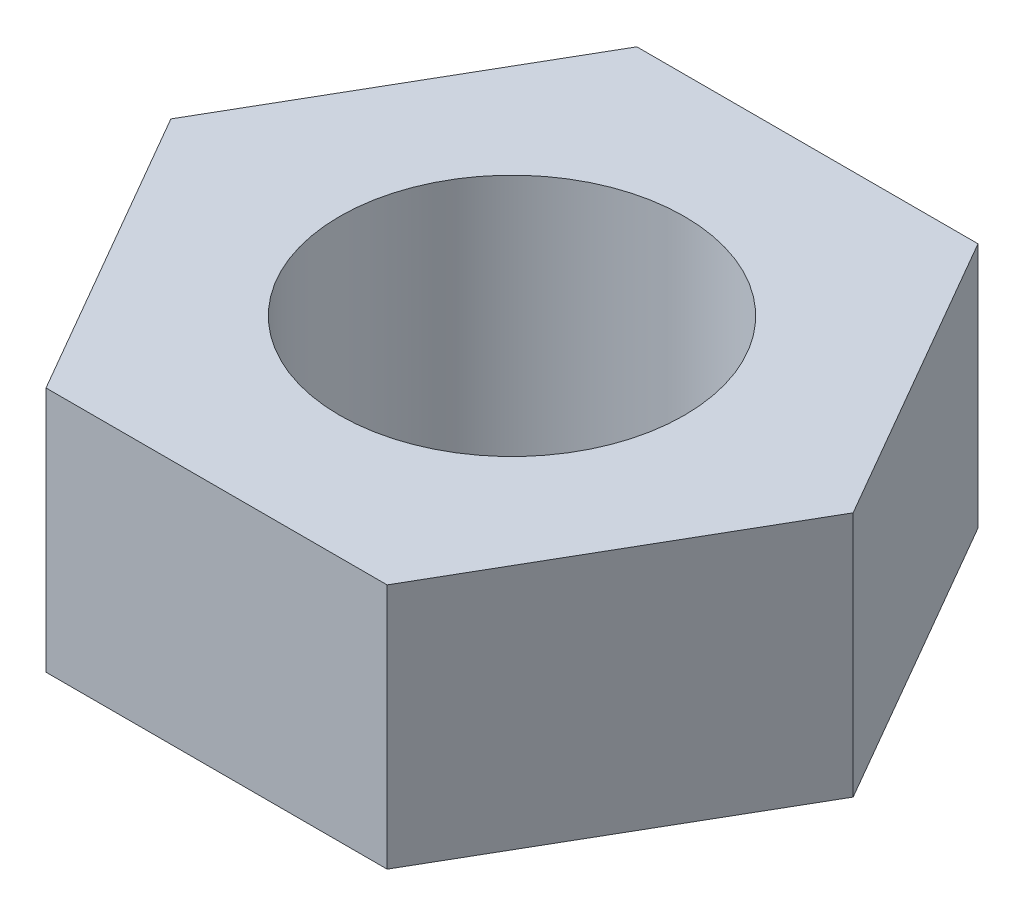
ISO-10303-21;
HEADER;
FILE_DESCRIPTION(('STEP AP214'),'2;1');
FILE_NAME('part.step','',(''),(''),'','','');
FILE_SCHEMA(('AUTOMOTIVE_DESIGN { 1 0 10303 214 1 1 1 1 }'));
ENDSEC;
DATA;
#1=APPLICATION_CONTEXT('core data for automotive mechanical design processes');
#2=APPLICATION_PROTOCOL_DEFINITION('international standard','automotive_design',2000,#1);
#3=PRODUCT_CONTEXT('',#1,'mechanical');
#4=PRODUCT('Part','Part','',(#3));
#5=PRODUCT_RELATED_PRODUCT_CATEGORY('part','',(#4));
#6=PRODUCT_DEFINITION_FORMATION('','',#4);
#7=PRODUCT_DEFINITION_CONTEXT('part definition',#1,'design');
#8=PRODUCT_DEFINITION('design','',#6,#7);
#9=PRODUCT_DEFINITION_SHAPE('','',#8);
#10=(LENGTH_UNIT() NAMED_UNIT(*) SI_UNIT(.MILLI.,.METRE.));
#11=(NAMED_UNIT(*) PLANE_ANGLE_UNIT() SI_UNIT($,.RADIAN.));
#12=(NAMED_UNIT(*) SI_UNIT($,.STERADIAN.) SOLID_ANGLE_UNIT());
#13=UNCERTAINTY_MEASURE_WITH_UNIT(LENGTH_MEASURE(1.E-05),#10,'distance_accuracy_value','');
#14=(GEOMETRIC_REPRESENTATION_CONTEXT(3) GLOBAL_UNCERTAINTY_ASSIGNED_CONTEXT((#13)) GLOBAL_UNIT_ASSIGNED_CONTEXT((#10,
#11,#12)) REPRESENTATION_CONTEXT('',''));
#15=CARTESIAN_POINT('',(0.,0.,0.));
#16=DIRECTION('',(0.,0.,1.));
#17=DIRECTION('',(1.,0.,0.));
#18=AXIS2_PLACEMENT_3D('',#15,#16,#17);
#19=CARTESIAN_POINT('',(0.,10.,0.));
#20=DIRECTION('',(0.,1.,0.));
#21=DIRECTION('',(0.,0.,1.));
#22=AXIS2_PLACEMENT_3D('',#19,#20,#21);
#23=PLANE('',#22);
#24=DIRECTION('',(-0.5,0.,-0.866025403784438));
#25=VECTOR('',#24,1.);
#26=CARTESIAN_POINT('',(13.856406460551,10.,0.));
#27=LINE('',#26,#25);
#28=CARTESIAN_POINT('',(13.856406460551,10.,0.));
#29=VERTEX_POINT('',#28);
#30=CARTESIAN_POINT('',(6.92820323027551,10.,-12.));
#31=VERTEX_POINT('',#30);
#32=EDGE_CURVE('E152',#29,#31,#27,.T.);
#33=ORIENTED_EDGE('',*,*,#32,.T.);
#34=DIRECTION('',(-1.,0.,0.));
#35=VECTOR('',#34,1.);
#36=CARTESIAN_POINT('',(6.92820323027551,10.,-12.));
#37=LINE('',#36,#35);
#38=CARTESIAN_POINT('',(-6.92820323027551,10.,-12.));
#39=VERTEX_POINT('',#38);
#40=EDGE_CURVE('E100',#31,#39,#37,.T.);
#41=ORIENTED_EDGE('',*,*,#40,.T.);
#42=DIRECTION('',(-0.5,0.,0.866025403784438));
#43=VECTOR('',#42,1.);
#44=CARTESIAN_POINT('',(-6.92820323027551,10.,-12.));
#45=LINE('',#44,#43);
#46=CARTESIAN_POINT('',(-13.856406460551,10.,0.));
#47=VERTEX_POINT('',#46);
#48=EDGE_CURVE('E113',#39,#47,#45,.T.);
#49=ORIENTED_EDGE('',*,*,#48,.T.);
#50=DIRECTION('',(0.5,0.,0.866025403784439));
#51=VECTOR('',#50,1.);
#52=CARTESIAN_POINT('',(-13.856406460551,10.,0.));
#53=LINE('',#52,#51);
#54=CARTESIAN_POINT('',(-6.92820323027551,10.,12.));
#55=VERTEX_POINT('',#54);
#56=EDGE_CURVE('E107',#47,#55,#53,.T.);
#57=ORIENTED_EDGE('',*,*,#56,.T.);
#58=DIRECTION('',(1.,0.,0.));
#59=VECTOR('',#58,1.);
#60=CARTESIAN_POINT('',(-6.92820323027551,10.,12.));
#61=LINE('',#60,#59);
#62=CARTESIAN_POINT('',(6.92820323027551,10.,12.));
#63=VERTEX_POINT('',#62);
#64=EDGE_CURVE('E111',#55,#63,#61,.T.);
#65=ORIENTED_EDGE('',*,*,#64,.T.);
#66=DIRECTION('',(0.5,0.,-0.866025403784439));
#67=VECTOR('',#66,1.);
#68=CARTESIAN_POINT('',(6.92820323027551,10.,12.));
#69=LINE('',#68,#67);
#70=EDGE_CURVE('E63',#63,#29,#69,.T.);
#71=ORIENTED_EDGE('',*,*,#70,.T.);
#72=EDGE_LOOP('',(#33,#41,#49,#57,#65,#71));
#73=FACE_BOUND('',#72,.T.);
#74=CARTESIAN_POINT('',(0.,10.,0.));
#75=DIRECTION('',(0.,1.,0.));
#76=DIRECTION('',(0.,0.,1.));
#77=AXIS2_PLACEMENT_3D('',#74,#75,#76);
#78=CIRCLE('',#77,7.);
#79=CARTESIAN_POINT('',(0.,10.,7.));
#80=VERTEX_POINT('',#79);
#81=EDGE_CURVE('E140',#80,#80,#78,.T.);
#82=ORIENTED_EDGE('',*,*,#81,.F.);
#83=EDGE_LOOP('',(#82));
#84=FACE_BOUND('',#83,.T.);
#85=ADVANCED_FACE('F45',(#73,#84),#23,.T.);
#86=CARTESIAN_POINT('',(0.,0.,0.));
#87=DIRECTION('',(0.,1.,0.));
#88=DIRECTION('',(0.,0.,1.));
#89=AXIS2_PLACEMENT_3D('',#86,#87,#88);
#90=PLANE('',#89);
#91=DIRECTION('',(-0.5,0.,-0.866025403784438));
#92=VECTOR('',#91,1.);
#93=CARTESIAN_POINT('',(13.856406460551,0.,0.));
#94=LINE('',#93,#92);
#95=CARTESIAN_POINT('',(13.856406460551,0.,0.));
#96=VERTEX_POINT('',#95);
#97=CARTESIAN_POINT('',(6.92820323027551,0.,-12.));
#98=VERTEX_POINT('',#97);
#99=EDGE_CURVE('E135',#96,#98,#94,.T.);
#100=ORIENTED_EDGE('',*,*,#99,.F.);
#101=DIRECTION('',(0.5,0.,-0.866025403784439));
#102=VECTOR('',#101,1.);
#103=CARTESIAN_POINT('',(6.92820323027551,0.,12.));
#104=LINE('',#103,#102);
#105=CARTESIAN_POINT('',(6.92820323027551,0.,12.));
#106=VERTEX_POINT('',#105);
#107=EDGE_CURVE('E92',#106,#96,#104,.T.);
#108=ORIENTED_EDGE('',*,*,#107,.F.);
#109=DIRECTION('',(1.,0.,0.));
#110=VECTOR('',#109,1.);
#111=CARTESIAN_POINT('',(-6.92820323027551,0.,12.));
#112=LINE('',#111,#110);
#113=CARTESIAN_POINT('',(-6.92820323027551,0.,12.));
#114=VERTEX_POINT('',#113);
#115=EDGE_CURVE('E86',#114,#106,#112,.T.);
#116=ORIENTED_EDGE('',*,*,#115,.F.);
#117=DIRECTION('',(0.5,0.,0.866025403784439));
#118=VECTOR('',#117,1.);
#119=CARTESIAN_POINT('',(-13.856406460551,0.,0.));
#120=LINE('',#119,#118);
#121=CARTESIAN_POINT('',(-13.856406460551,0.,0.));
#122=VERTEX_POINT('',#121);
#123=EDGE_CURVE('E122',#122,#114,#120,.T.);
#124=ORIENTED_EDGE('',*,*,#123,.F.);
#125=DIRECTION('',(-0.5,0.,0.866025403784438));
#126=VECTOR('',#125,1.);
#127=CARTESIAN_POINT('',(-6.92820323027551,0.,-12.));
#128=LINE('',#127,#126);
#129=CARTESIAN_POINT('',(-6.92820323027551,0.,-12.));
#130=VERTEX_POINT('',#129);
#131=EDGE_CURVE('E143',#130,#122,#128,.T.);
#132=ORIENTED_EDGE('',*,*,#131,.F.);
#133=DIRECTION('',(-1.,0.,0.));
#134=VECTOR('',#133,1.);
#135=CARTESIAN_POINT('',(6.92820323027551,0.,-12.));
#136=LINE('',#135,#134);
#137=EDGE_CURVE('E139',#98,#130,#136,.T.);
#138=ORIENTED_EDGE('',*,*,#137,.F.);
#139=EDGE_LOOP('',(#100,#108,#116,#124,#132,#138));
#140=FACE_BOUND('',#139,.T.);
#141=CARTESIAN_POINT('',(0.,0.,0.));
#142=DIRECTION('',(0.,1.,0.));
#143=DIRECTION('',(0.,0.,1.));
#144=AXIS2_PLACEMENT_3D('',#141,#142,#143);
#145=CIRCLE('',#144,7.);
#146=CARTESIAN_POINT('',(0.,0.,7.));
#147=VERTEX_POINT('',#146);
#148=EDGE_CURVE('E249',#147,#147,#145,.T.);
#149=ORIENTED_EDGE('',*,*,#148,.T.);
#150=EDGE_LOOP('',(#149));
#151=FACE_BOUND('',#150,.T.);
#152=ADVANCED_FACE('F165',(#140,#151),#90,.F.);
#153=CARTESIAN_POINT('',(13.856406460551,10.,0.));
#154=DIRECTION('',(-0.866025403784438,0.,0.5));
#155=DIRECTION('',(0.5,0.,0.866025403784439));
#156=AXIS2_PLACEMENT_3D('',#153,#154,#155);
#157=PLANE('',#156);
#158=ORIENTED_EDGE('',*,*,#99,.T.);
#159=DIRECTION('',(0.,-1.,0.));
#160=VECTOR('',#159,1.);
#161=CARTESIAN_POINT('',(6.92820323027551,10.,-12.));
#162=LINE('',#161,#160);
#163=EDGE_CURVE('E11',#31,#98,#162,.T.);
#164=ORIENTED_EDGE('',*,*,#163,.F.);
#165=ORIENTED_EDGE('',*,*,#32,.F.);
#166=DIRECTION('',(0.,-1.,0.));
#167=VECTOR('',#166,1.);
#168=CARTESIAN_POINT('',(13.856406460551,10.,0.));
#169=LINE('',#168,#167);
#170=EDGE_CURVE('E131',#29,#96,#169,.T.);
#171=ORIENTED_EDGE('',*,*,#170,.T.);
#172=EDGE_LOOP('',(#158,#164,#165,#171));
#173=FACE_BOUND('',#172,.T.);
#174=ADVANCED_FACE('F47',(#173),#157,.F.);
#175=CARTESIAN_POINT('',(6.92820323027551,10.,-12.));
#176=DIRECTION('',(0.,0.,1.));
#177=DIRECTION('',(1.,0.,0.));
#178=AXIS2_PLACEMENT_3D('',#175,#176,#177);
#179=PLANE('',#178);
#180=ORIENTED_EDGE('',*,*,#137,.T.);
#181=DIRECTION('',(0.,-1.,0.));
#182=VECTOR('',#181,1.);
#183=CARTESIAN_POINT('',(-6.92820323027551,10.,-12.));
#184=LINE('',#183,#182);
#185=EDGE_CURVE('E55',#39,#130,#184,.T.);
#186=ORIENTED_EDGE('',*,*,#185,.F.);
#187=ORIENTED_EDGE('',*,*,#40,.F.);
#188=ORIENTED_EDGE('',*,*,#163,.T.);
#189=EDGE_LOOP('',(#180,#186,#187,#188));
#190=FACE_BOUND('',#189,.T.);
#191=ADVANCED_FACE('F190',(#190),#179,.F.);
#192=CARTESIAN_POINT('',(-6.92820323027551,10.,-12.));
#193=DIRECTION('',(0.866025403784438,0.,0.5));
#194=DIRECTION('',(0.5,0.,-0.866025403784439));
#195=AXIS2_PLACEMENT_3D('',#192,#193,#194);
#196=PLANE('',#195);
#197=ORIENTED_EDGE('',*,*,#131,.T.);
#198=DIRECTION('',(0.,-1.,0.));
#199=VECTOR('',#198,1.);
#200=CARTESIAN_POINT('',(-13.856406460551,10.,0.));
#201=LINE('',#200,#199);
#202=EDGE_CURVE('E124',#47,#122,#201,.T.);
#203=ORIENTED_EDGE('',*,*,#202,.F.);
#204=ORIENTED_EDGE('',*,*,#48,.F.);
#205=ORIENTED_EDGE('',*,*,#185,.T.);
#206=EDGE_LOOP('',(#197,#203,#204,#205));
#207=FACE_BOUND('',#206,.T.);
#208=ADVANCED_FACE('F162',(#207),#196,.F.);
#209=CARTESIAN_POINT('',(-13.856406460551,10.,0.));
#210=DIRECTION('',(0.866025403784439,0.,-0.5));
#211=DIRECTION('',(-0.5,0.,-0.866025403784439));
#212=AXIS2_PLACEMENT_3D('',#209,#210,#211);
#213=PLANE('',#212);
#214=ORIENTED_EDGE('',*,*,#123,.T.);
#215=DIRECTION('',(0.,-1.,0.));
#216=VECTOR('',#215,1.);
#217=CARTESIAN_POINT('',(-6.92820323027551,10.,12.));
#218=LINE('',#217,#216);
#219=EDGE_CURVE('E119',#55,#114,#218,.T.);
#220=ORIENTED_EDGE('',*,*,#219,.F.);
#221=ORIENTED_EDGE('',*,*,#56,.F.);
#222=ORIENTED_EDGE('',*,*,#202,.T.);
#223=EDGE_LOOP('',(#214,#220,#221,#222));
#224=FACE_BOUND('',#223,.T.);
#225=ADVANCED_FACE('F120',(#224),#213,.F.);
#226=CARTESIAN_POINT('',(-6.92820323027551,10.,12.));
#227=DIRECTION('',(0.,0.,-1.));
#228=DIRECTION('',(-1.,0.,0.));
#229=AXIS2_PLACEMENT_3D('',#226,#227,#228);
#230=PLANE('',#229);
#231=ORIENTED_EDGE('',*,*,#115,.T.);
#232=DIRECTION('',(0.,-1.,0.));
#233=VECTOR('',#232,1.);
#234=CARTESIAN_POINT('',(6.92820323027551,10.,12.));
#235=LINE('',#234,#233);
#236=EDGE_CURVE('E125',#63,#106,#235,.T.);
#237=ORIENTED_EDGE('',*,*,#236,.F.);
#238=ORIENTED_EDGE('',*,*,#64,.F.);
#239=ORIENTED_EDGE('',*,*,#219,.T.);
#240=EDGE_LOOP('',(#231,#237,#238,#239));
#241=FACE_BOUND('',#240,.T.);
#242=ADVANCED_FACE('F127',(#241),#230,.F.);
#243=CARTESIAN_POINT('',(6.92820323027551,10.,12.));
#244=DIRECTION('',(-0.866025403784439,0.,-0.5));
#245=DIRECTION('',(-0.5,0.,0.866025403784439));
#246=AXIS2_PLACEMENT_3D('',#243,#244,#245);
#247=PLANE('',#246);
#248=ORIENTED_EDGE('',*,*,#107,.T.);
#249=ORIENTED_EDGE('',*,*,#170,.F.);
#250=ORIENTED_EDGE('',*,*,#70,.F.);
#251=ORIENTED_EDGE('',*,*,#236,.T.);
#252=EDGE_LOOP('',(#248,#249,#250,#251));
#253=FACE_BOUND('',#252,.T.);
#254=ADVANCED_FACE('F170',(#253),#247,.F.);
#255=CARTESIAN_POINT('',(0.,10.,0.));
#256=DIRECTION('',(0.,-1.,0.));
#257=DIRECTION('',(0.,0.,-1.));
#258=AXIS2_PLACEMENT_3D('',#255,#256,#257);
#259=CYLINDRICAL_SURFACE('',#258,7.);
#260=ORIENTED_EDGE('',*,*,#81,.T.);
#261=EDGE_LOOP('',(#260));
#262=FACE_BOUND('',#261,.T.);
#263=ORIENTED_EDGE('',*,*,#148,.F.);
#264=EDGE_LOOP('',(#263));
#265=FACE_BOUND('',#264,.T.);
#266=ADVANCED_FACE('F172',(#262,#265),#259,.F.);
#267=CLOSED_SHELL('',(#85,#152,#174,#191,#208,#225,#242,#254,#266));
#268=MANIFOLD_SOLID_BREP('B2',#267);
#269=ADVANCED_BREP_SHAPE_REPRESENTATION('',(#18,#268),#14);
#270=SHAPE_DEFINITION_REPRESENTATION(#9,#269);
ENDSEC;
END-ISO-10303-21;
